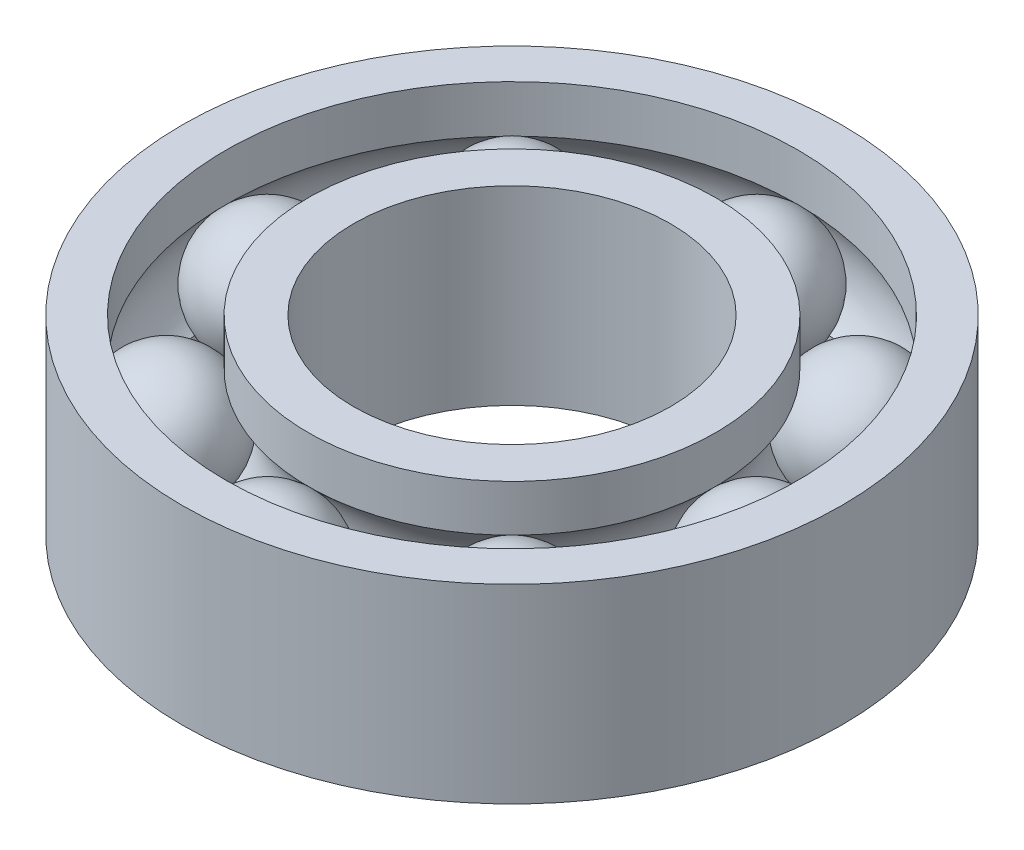
ISO-10303-21;
HEADER;
FILE_DESCRIPTION(('STEP AP214'),'2;1');
FILE_NAME('part.step','',(''),(''),'','','');
FILE_SCHEMA(('AUTOMOTIVE_DESIGN { 1 0 10303 214 1 1 1 1 }'));
ENDSEC;
DATA;
#1=APPLICATION_CONTEXT('core data for automotive mechanical design processes');
#2=APPLICATION_PROTOCOL_DEFINITION('international standard','automotive_design',2000,#1);
#3=PRODUCT_CONTEXT('',#1,'mechanical');
#4=PRODUCT('Part','Part','',(#3));
#5=PRODUCT_RELATED_PRODUCT_CATEGORY('part','',(#4));
#6=PRODUCT_DEFINITION_FORMATION('','',#4);
#7=PRODUCT_DEFINITION_CONTEXT('part definition',#1,'design');
#8=PRODUCT_DEFINITION('design','',#6,#7);
#9=PRODUCT_DEFINITION_SHAPE('','',#8);
#10=(LENGTH_UNIT() NAMED_UNIT(*) SI_UNIT(.MILLI.,.METRE.));
#11=(NAMED_UNIT(*) PLANE_ANGLE_UNIT() SI_UNIT($,.RADIAN.));
#12=(NAMED_UNIT(*) SI_UNIT($,.STERADIAN.) SOLID_ANGLE_UNIT());
#13=UNCERTAINTY_MEASURE_WITH_UNIT(LENGTH_MEASURE(1.E-05),#10,'distance_accuracy_value','');
#14=(GEOMETRIC_REPRESENTATION_CONTEXT(3) GLOBAL_UNCERTAINTY_ASSIGNED_CONTEXT((#13)) GLOBAL_UNIT_ASSIGNED_CONTEXT((#10,
#11,#12)) REPRESENTATION_CONTEXT('',''));
#15=CARTESIAN_POINT('',(0.,0.,0.));
#16=DIRECTION('',(0.,0.,1.));
#17=DIRECTION('',(1.,0.,0.));
#18=AXIS2_PLACEMENT_3D('',#15,#16,#17);
#19=CARTESIAN_POINT('',(-13.6326212192178,0.,13.6326212192175));
#20=DIRECTION('',(0.,-1.,0.));
#21=DIRECTION('',(-0.707106781186556,0.,0.707106781186539));
#22=AXIS2_PLACEMENT_3D('',#19,#20,#21);
#23=SPHERICAL_SURFACE('',#22,5.);
#24=CARTESIAN_POINT('',(-13.6326212192178,-5.00000000000002,13.6326212192175));
#25=VERTEX_POINT('',#24);
#26=VERTEX_LOOP('',#25);
#27=FACE_BOUND('',#26,.T.);
#28=ADVANCED_FACE('F47',(#27),#23,.T.);
#29=CLOSED_SHELL('',(#28));
#30=MANIFOLD_SOLID_BREP('B2',#29);
#31=CARTESIAN_POINT('',(-2.01941392104362E-13,0.,19.2794378189128));
#32=DIRECTION('',(0.,-1.,0.));
#33=DIRECTION('',(0.,0.,1.));
#34=AXIS2_PLACEMENT_3D('',#31,#32,#33);
#35=SPHERICAL_SURFACE('',#34,5.);
#36=CARTESIAN_POINT('',(-2.01941392104362E-13,-5.00000000000002,19.2794378189128));
#37=VERTEX_POINT('',#36);
#38=VERTEX_LOOP('',#37);
#39=FACE_BOUND('',#38,.T.);
#40=ADVANCED_FACE('F70',(#39),#35,.T.);
#41=CLOSED_SHELL('',(#40));
#42=MANIFOLD_SOLID_BREP('B6',#41);
#43=CARTESIAN_POINT('',(13.6326212192175,0.,13.6326212192178));
#44=DIRECTION('',(0.,-1.,0.));
#45=DIRECTION('',(0.707106781186541,0.,0.707106781186554));
#46=AXIS2_PLACEMENT_3D('',#43,#44,#45);
#47=SPHERICAL_SURFACE('',#46,5.);
#48=CARTESIAN_POINT('',(13.6326212192175,-5.00000000000002,13.6326212192178));
#49=VERTEX_POINT('',#48);
#50=VERTEX_LOOP('',#49);
#51=FACE_BOUND('',#50,.T.);
#52=ADVANCED_FACE('F93',(#51),#47,.T.);
#53=CLOSED_SHELL('',(#52));
#54=MANIFOLD_SOLID_BREP('B43',#53);
#55=CARTESIAN_POINT('',(19.2794378189128,0.,0.));
#56=DIRECTION('',(0.,-1.,0.));
#57=DIRECTION('',(1.,0.,0.));
#58=AXIS2_PLACEMENT_3D('',#55,#56,#57);
#59=SPHERICAL_SURFACE('',#58,5.);
#60=CARTESIAN_POINT('',(19.2794378189128,-5.00000000000002,0.));
#61=VERTEX_POINT('',#60);
#62=VERTEX_LOOP('',#61);
#63=FACE_BOUND('',#62,.T.);
#64=ADVANCED_FACE('F116',(#63),#59,.T.);
#65=CLOSED_SHELL('',(#64));
#66=MANIFOLD_SOLID_BREP('B66',#65);
#67=CARTESIAN_POINT('',(13.6326212192177,0.,-13.6326212192176));
#68=DIRECTION('',(0.,-1.,0.));
#69=DIRECTION('',(0.707106781186551,0.,-0.707106781186544));
#70=AXIS2_PLACEMENT_3D('',#67,#68,#69);
#71=SPHERICAL_SURFACE('',#70,5.);
#72=CARTESIAN_POINT('',(13.6326212192177,-5.00000000000002,-13.6326212192176));
#73=VERTEX_POINT('',#72);
#74=VERTEX_LOOP('',#73);
#75=FACE_BOUND('',#74,.T.);
#76=ADVANCED_FACE('F139',(#75),#71,.T.);
#77=CLOSED_SHELL('',(#76));
#78=MANIFOLD_SOLID_BREP('B89',#77);
#79=CARTESIAN_POINT('',(0.,0.,-19.2794378189128));
#80=DIRECTION('',(0.,-1.,0.));
#81=DIRECTION('',(0.,0.,-1.));
#82=AXIS2_PLACEMENT_3D('',#79,#80,#81);
#83=SPHERICAL_SURFACE('',#82,5.);
#84=CARTESIAN_POINT('',(0.,-5.00000000000002,-19.2794378189128));
#85=VERTEX_POINT('',#84);
#86=VERTEX_LOOP('',#85);
#87=FACE_BOUND('',#86,.T.);
#88=ADVANCED_FACE('F162',(#87),#83,.T.);
#89=CLOSED_SHELL('',(#88));
#90=MANIFOLD_SOLID_BREP('B112',#89);
#91=CARTESIAN_POINT('',(-13.6326212192176,0.,-13.6326212192177));
#92=DIRECTION('',(0.,-1.,0.));
#93=DIRECTION('',(-0.707106781186546,0.,-0.707106781186549));
#94=AXIS2_PLACEMENT_3D('',#91,#92,#93);
#95=SPHERICAL_SURFACE('',#94,5.);
#96=CARTESIAN_POINT('',(-13.6326212192176,-5.00000000000002,-13.6326212192177));
#97=VERTEX_POINT('',#96);
#98=VERTEX_LOOP('',#97);
#99=FACE_BOUND('',#98,.T.);
#100=ADVANCED_FACE('F187',(#99),#95,.T.);
#101=CLOSED_SHELL('',(#100));
#102=MANIFOLD_SOLID_BREP('B135',#101);
#103=CARTESIAN_POINT('',(0.,0.,0.));
#104=DIRECTION('',(0.,-1.,0.));
#105=DIRECTION('',(0.,0.,-1.));
#106=AXIS2_PLACEMENT_3D('',#103,#104,#105);
#107=TOROIDAL_SURFACE('',#106,19.2794378189128,5.);
#108=CARTESIAN_POINT('',(0.,3.8246541330885,0.));
#109=DIRECTION('',(0.,-1.,0.));
#110=DIRECTION('',(0.,0.,-1.));
#111=AXIS2_PLACEMENT_3D('',#108,#109,#110);
#112=CIRCLE('',#111,16.0588756378257);
#113=CARTESIAN_POINT('',(0.,3.8246541330885,-16.0588756378257));
#114=VERTEX_POINT('',#113);
#115=EDGE_CURVE('E234',#114,#114,#112,.T.);
#116=ORIENTED_EDGE('',*,*,#115,.T.);
#117=EDGE_LOOP('',(#116));
#118=FACE_BOUND('',#117,.T.);
#119=CARTESIAN_POINT('',(0.,-3.82465413308853,0.));
#120=DIRECTION('',(0.,-1.,0.));
#121=DIRECTION('',(0.,0.,-1.));
#122=AXIS2_PLACEMENT_3D('',#119,#120,#121);
#123=CIRCLE('',#122,16.0588756378257);
#124=CARTESIAN_POINT('',(0.,-3.82465413308853,-16.0588756378257));
#125=VERTEX_POINT('',#124);
#126=EDGE_CURVE('E186',#125,#125,#123,.T.);
#127=ORIENTED_EDGE('',*,*,#126,.F.);
#128=EDGE_LOOP('',(#127));
#129=FACE_BOUND('',#128,.T.);
#130=ADVANCED_FACE('F212',(#118,#129),#107,.F.);
#131=CARTESIAN_POINT('',(0.,-15.906758568596,0.));
#132=DIRECTION('',(0.,-1.,0.));
#133=DIRECTION('',(0.,0.,-1.));
#134=AXIS2_PLACEMENT_3D('',#131,#132,#133);
#135=CYLINDRICAL_SURFACE('',#134,16.0588756378257);
#136=CARTESIAN_POINT('',(0.,-7.5,0.));
#137=DIRECTION('',(0.,-1.,0.));
#138=DIRECTION('',(0.,0.,-1.));
#139=AXIS2_PLACEMENT_3D('',#136,#137,#138);
#140=CIRCLE('',#139,16.0588756378257);
#141=CARTESIAN_POINT('',(0.,-7.5,-16.0588756378257));
#142=VERTEX_POINT('',#141);
#143=EDGE_CURVE('E218',#142,#142,#140,.T.);
#144=ORIENTED_EDGE('',*,*,#143,.F.);
#145=EDGE_LOOP('',(#144));
#146=FACE_BOUND('',#145,.T.);
#147=ORIENTED_EDGE('',*,*,#126,.T.);
#148=EDGE_LOOP('',(#147));
#149=FACE_BOUND('',#148,.T.);
#150=ADVANCED_FACE('F258',(#146,#149),#135,.T.);
#151=CARTESIAN_POINT('',(0.,-7.5,0.));
#152=DIRECTION('',(0.,1.,0.));
#153=DIRECTION('',(0.,0.,1.));
#154=AXIS2_PLACEMENT_3D('',#151,#152,#153);
#155=PLANE('',#154);
#156=CARTESIAN_POINT('',(0.,-7.5,0.));
#157=DIRECTION('',(0.,-1.,0.));
#158=DIRECTION('',(0.,0.,-1.));
#159=AXIS2_PLACEMENT_3D('',#156,#157,#158);
#160=CIRCLE('',#159,12.5);
#161=CARTESIAN_POINT('',(0.,-7.5,-12.5));
#162=VERTEX_POINT('',#161);
#163=EDGE_CURVE('E222',#162,#162,#160,.T.);
#164=ORIENTED_EDGE('',*,*,#163,.F.);
#165=EDGE_LOOP('',(#164));
#166=FACE_BOUND('',#165,.T.);
#167=ORIENTED_EDGE('',*,*,#143,.T.);
#168=EDGE_LOOP('',(#167));
#169=FACE_BOUND('',#168,.T.);
#170=ADVANCED_FACE('F254',(#166,#169),#155,.F.);
#171=CARTESIAN_POINT('',(0.,-15.906758568596,0.));
#172=DIRECTION('',(0.,-1.,0.));
#173=DIRECTION('',(0.,0.,-1.));
#174=AXIS2_PLACEMENT_3D('',#171,#172,#173);
#175=CYLINDRICAL_SURFACE('',#174,12.5);
#176=ORIENTED_EDGE('',*,*,#163,.T.);
#177=EDGE_LOOP('',(#176));
#178=FACE_BOUND('',#177,.T.);
#179=CARTESIAN_POINT('',(0.,7.5,0.));
#180=DIRECTION('',(0.,-1.,0.));
#181=DIRECTION('',(0.,0.,-1.));
#182=AXIS2_PLACEMENT_3D('',#179,#180,#181);
#183=CIRCLE('',#182,12.5);
#184=CARTESIAN_POINT('',(0.,7.5,-12.5));
#185=VERTEX_POINT('',#184);
#186=EDGE_CURVE('E226',#185,#185,#183,.T.);
#187=ORIENTED_EDGE('',*,*,#186,.F.);
#188=EDGE_LOOP('',(#187));
#189=FACE_BOUND('',#188,.T.);
#190=ADVANCED_FACE('F248',(#178,#189),#175,.F.);
#191=CARTESIAN_POINT('',(0.,7.5,0.));
#192=DIRECTION('',(0.,1.,0.));
#193=DIRECTION('',(0.,0.,1.));
#194=AXIS2_PLACEMENT_3D('',#191,#192,#193);
#195=PLANE('',#194);
#196=ORIENTED_EDGE('',*,*,#186,.T.);
#197=EDGE_LOOP('',(#196));
#198=FACE_BOUND('',#197,.T.);
#199=CARTESIAN_POINT('',(0.,7.5,0.));
#200=DIRECTION('',(0.,-1.,0.));
#201=DIRECTION('',(0.,0.,-1.));
#202=AXIS2_PLACEMENT_3D('',#199,#200,#201);
#203=CIRCLE('',#202,16.0588756378257);
#204=CARTESIAN_POINT('',(0.,7.5,-16.0588756378257));
#205=VERTEX_POINT('',#204);
#206=EDGE_CURVE('E231',#205,#205,#203,.T.);
#207=ORIENTED_EDGE('',*,*,#206,.F.);
#208=EDGE_LOOP('',(#207));
#209=FACE_BOUND('',#208,.T.);
#210=ADVANCED_FACE('F243',(#198,#209),#195,.T.);
#211=CARTESIAN_POINT('',(0.,-15.906758568596,0.));
#212=DIRECTION('',(0.,-1.,0.));
#213=DIRECTION('',(0.,0.,-1.));
#214=AXIS2_PLACEMENT_3D('',#211,#212,#213);
#215=CYLINDRICAL_SURFACE('',#214,16.0588756378257);
#216=ORIENTED_EDGE('',*,*,#115,.F.);
#217=EDGE_LOOP('',(#216));
#218=FACE_BOUND('',#217,.T.);
#219=ORIENTED_EDGE('',*,*,#206,.T.);
#220=EDGE_LOOP('',(#219));
#221=FACE_BOUND('',#220,.T.);
#222=ADVANCED_FACE('F240',(#218,#221),#215,.T.);
#223=CLOSED_SHELL('',(#130,#150,#170,#190,#210,#222));
#224=MANIFOLD_SOLID_BREP('B158',#223);
#225=CARTESIAN_POINT('',(0.,0.,0.));
#226=DIRECTION('',(0.,-1.,0.));
#227=DIRECTION('',(0.,0.,-1.));
#228=AXIS2_PLACEMENT_3D('',#225,#226,#227);
#229=TOROIDAL_SURFACE('',#228,19.2794378189128,5.);
#230=CARTESIAN_POINT('',(0.,-3.77429299232112,0.));
#231=DIRECTION('',(0.,-1.,0.));
#232=DIRECTION('',(0.,0.,-1.));
#233=AXIS2_PLACEMENT_3D('',#230,#231,#232);
#234=CIRCLE('',#233,22.5588756378257);
#235=CARTESIAN_POINT('',(0.,-3.77429299232112,-22.5588756378257));
#236=VERTEX_POINT('',#235);
#237=EDGE_CURVE('E342',#236,#236,#234,.T.);
#238=ORIENTED_EDGE('',*,*,#237,.T.);
#239=EDGE_LOOP('',(#238));
#240=FACE_BOUND('',#239,.T.);
#241=CARTESIAN_POINT('',(0.,3.7742929923211,0.));
#242=DIRECTION('',(0.,-1.,0.));
#243=DIRECTION('',(0.,0.,-1.));
#244=AXIS2_PLACEMENT_3D('',#241,#242,#243);
#245=CIRCLE('',#244,22.5588756378257);
#246=CARTESIAN_POINT('',(0.,3.7742929923211,-22.5588756378257));
#247=VERTEX_POINT('',#246);
#248=EDGE_CURVE('E211',#247,#247,#245,.T.);
#249=ORIENTED_EDGE('',*,*,#248,.F.);
#250=EDGE_LOOP('',(#249));
#251=FACE_BOUND('',#250,.T.);
#252=ADVANCED_FACE('F320',(#240,#251),#229,.F.);
#253=CARTESIAN_POINT('',(0.,-15.906758568596,0.));
#254=DIRECTION('',(0.,-1.,0.));
#255=DIRECTION('',(0.,0.,-1.));
#256=AXIS2_PLACEMENT_3D('',#253,#254,#255);
#257=CYLINDRICAL_SURFACE('',#256,22.5588756378257);
#258=ORIENTED_EDGE('',*,*,#248,.T.);
#259=EDGE_LOOP('',(#258));
#260=FACE_BOUND('',#259,.T.);
#261=CARTESIAN_POINT('',(0.,7.5,0.));
#262=DIRECTION('',(0.,-1.,0.));
#263=DIRECTION('',(0.,0.,-1.));
#264=AXIS2_PLACEMENT_3D('',#261,#262,#263);
#265=CIRCLE('',#264,22.5588756378257);
#266=CARTESIAN_POINT('',(0.,7.5,-22.5588756378257));
#267=VERTEX_POINT('',#266);
#268=EDGE_CURVE('E326',#267,#267,#265,.T.);
#269=ORIENTED_EDGE('',*,*,#268,.F.);
#270=EDGE_LOOP('',(#269));
#271=FACE_BOUND('',#270,.T.);
#272=ADVANCED_FACE('F360',(#260,#271),#257,.F.);
#273=CARTESIAN_POINT('',(0.,7.5,0.));
#274=DIRECTION('',(0.,1.,0.));
#275=DIRECTION('',(0.,0.,1.));
#276=AXIS2_PLACEMENT_3D('',#273,#274,#275);
#277=PLANE('',#276);
#278=ORIENTED_EDGE('',*,*,#268,.T.);
#279=EDGE_LOOP('',(#278));
#280=FACE_BOUND('',#279,.T.);
#281=CARTESIAN_POINT('',(0.,7.5,0.));
#282=DIRECTION('',(0.,-1.,0.));
#283=DIRECTION('',(0.,0.,-1.));
#284=AXIS2_PLACEMENT_3D('',#281,#282,#283);
#285=CIRCLE('',#284,26.);
#286=CARTESIAN_POINT('',(0.,7.5,-26.));
#287=VERTEX_POINT('',#286);
#288=EDGE_CURVE('E330',#287,#287,#285,.T.);
#289=ORIENTED_EDGE('',*,*,#288,.F.);
#290=EDGE_LOOP('',(#289));
#291=FACE_BOUND('',#290,.T.);
#292=ADVANCED_FACE('F364',(#280,#291),#277,.T.);
#293=CARTESIAN_POINT('',(0.,-15.906758568596,0.));
#294=DIRECTION('',(0.,-1.,0.));
#295=DIRECTION('',(0.,0.,-1.));
#296=AXIS2_PLACEMENT_3D('',#293,#294,#295);
#297=CYLINDRICAL_SURFACE('',#296,26.);
#298=CARTESIAN_POINT('',(0.,-7.5,0.));
#299=DIRECTION('',(0.,-1.,0.));
#300=DIRECTION('',(0.,0.,-1.));
#301=AXIS2_PLACEMENT_3D('',#298,#299,#300);
#302=CIRCLE('',#301,26.);
#303=CARTESIAN_POINT('',(0.,-7.5,-26.));
#304=VERTEX_POINT('',#303);
#305=EDGE_CURVE('E334',#304,#304,#302,.T.);
#306=ORIENTED_EDGE('',*,*,#305,.F.);
#307=EDGE_LOOP('',(#306));
#308=FACE_BOUND('',#307,.T.);
#309=ORIENTED_EDGE('',*,*,#288,.T.);
#310=EDGE_LOOP('',(#309));
#311=FACE_BOUND('',#310,.T.);
#312=ADVANCED_FACE('F356',(#308,#311),#297,.T.);
#313=CARTESIAN_POINT('',(0.,-7.5,0.));
#314=DIRECTION('',(0.,1.,0.));
#315=DIRECTION('',(0.,0.,1.));
#316=AXIS2_PLACEMENT_3D('',#313,#314,#315);
#317=PLANE('',#316);
#318=CARTESIAN_POINT('',(0.,-7.5,0.));
#319=DIRECTION('',(0.,-1.,0.));
#320=DIRECTION('',(0.,0.,-1.));
#321=AXIS2_PLACEMENT_3D('',#318,#319,#320);
#322=CIRCLE('',#321,22.5588756378257);
#323=CARTESIAN_POINT('',(0.,-7.5,-22.5588756378257));
#324=VERTEX_POINT('',#323);
#325=EDGE_CURVE('E339',#324,#324,#322,.T.);
#326=ORIENTED_EDGE('',*,*,#325,.F.);
#327=EDGE_LOOP('',(#326));
#328=FACE_BOUND('',#327,.T.);
#329=ORIENTED_EDGE('',*,*,#305,.T.);
#330=EDGE_LOOP('',(#329));
#331=FACE_BOUND('',#330,.T.);
#332=ADVANCED_FACE('F350',(#328,#331),#317,.F.);
#333=CARTESIAN_POINT('',(0.,-15.906758568596,0.));
#334=DIRECTION('',(0.,-1.,0.));
#335=DIRECTION('',(0.,0.,-1.));
#336=AXIS2_PLACEMENT_3D('',#333,#334,#335);
#337=CYLINDRICAL_SURFACE('',#336,22.5588756378257);
#338=ORIENTED_EDGE('',*,*,#325,.T.);
#339=EDGE_LOOP('',(#338));
#340=FACE_BOUND('',#339,.T.);
#341=ORIENTED_EDGE('',*,*,#237,.F.);
#342=EDGE_LOOP('',(#341));
#343=FACE_BOUND('',#342,.T.);
#344=ADVANCED_FACE('F348',(#340,#343),#337,.F.);
#345=CLOSED_SHELL('',(#252,#272,#292,#312,#332,#344));
#346=MANIFOLD_SOLID_BREP('B181',#345);
#347=CARTESIAN_POINT('',(-19.2794378189128,0.,0.));
#348=DIRECTION('',(0.,-1.,0.));
#349=DIRECTION('',(-1.,0.,0.));
#350=AXIS2_PLACEMENT_3D('',#347,#348,#349);
#351=SPHERICAL_SURFACE('',#350,5.);
#352=CARTESIAN_POINT('',(-19.2794378189128,-5.00000000000002,0.));
#353=VERTEX_POINT('',#352);
#354=VERTEX_LOOP('',#353);
#355=FACE_BOUND('',#354,.T.);
#356=ADVANCED_FACE('F432',(#355),#351,.T.);
#357=CLOSED_SHELL('',(#356));
#358=MANIFOLD_SOLID_BREP('B206',#357);
#359=ADVANCED_BREP_SHAPE_REPRESENTATION('',(#18,#30,#42,#54,#66,#78,#90,#102,#224,#346,#358),#14);
#360=SHAPE_DEFINITION_REPRESENTATION(#9,#359);
ENDSEC;
END-ISO-10303-21;
